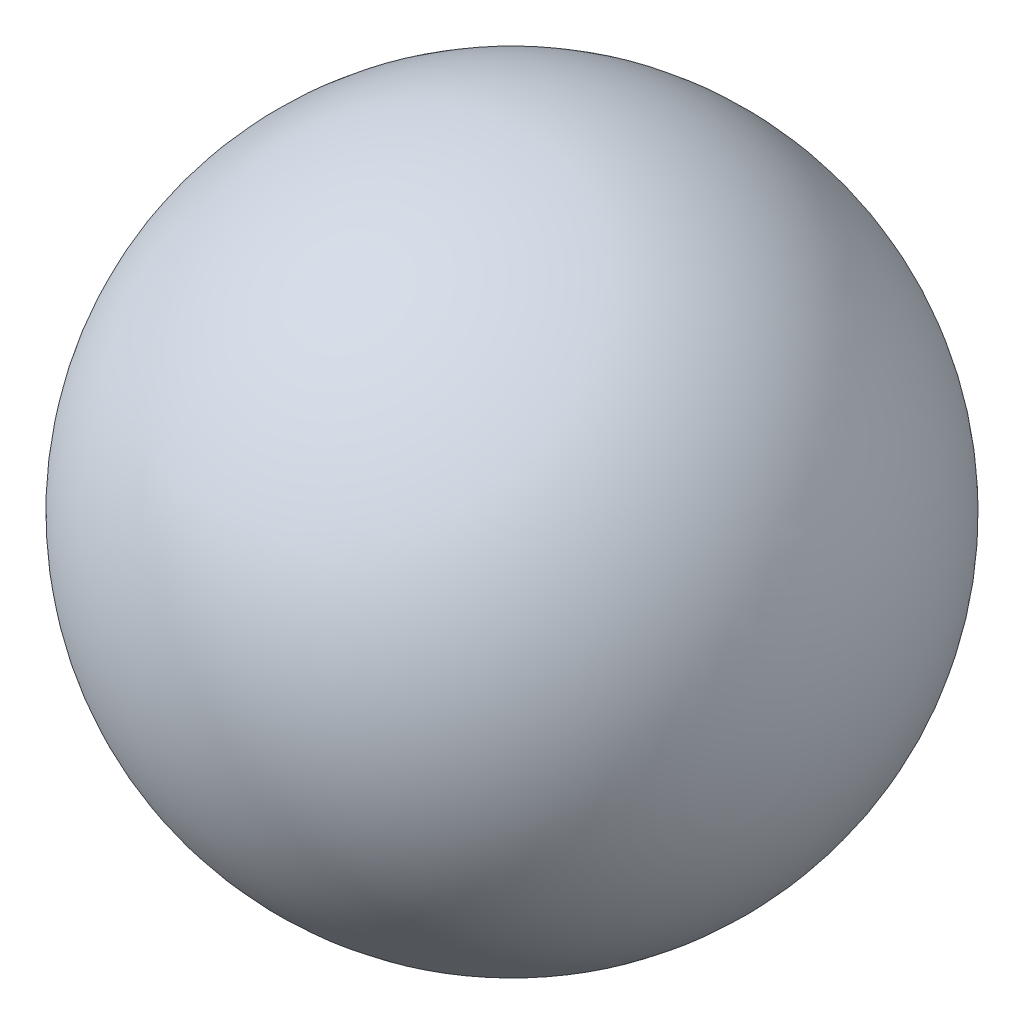
ISO-10303-21;
HEADER;
FILE_DESCRIPTION(('STEP AP214'),'2;1');
FILE_NAME('part.step','',(''),(''),'','','');
FILE_SCHEMA(('AUTOMOTIVE_DESIGN { 1 0 10303 214 1 1 1 1 }'));
ENDSEC;
DATA;
#1=APPLICATION_CONTEXT('core data for automotive mechanical design processes');
#2=APPLICATION_PROTOCOL_DEFINITION('international standard','automotive_design',2000,#1);
#3=PRODUCT_CONTEXT('',#1,'mechanical');
#4=PRODUCT('Part','Part','',(#3));
#5=PRODUCT_RELATED_PRODUCT_CATEGORY('part','',(#4));
#6=PRODUCT_DEFINITION_FORMATION('','',#4);
#7=PRODUCT_DEFINITION_CONTEXT('part definition',#1,'design');
#8=PRODUCT_DEFINITION('design','',#6,#7);
#9=PRODUCT_DEFINITION_SHAPE('','',#8);
#10=(LENGTH_UNIT() NAMED_UNIT(*) SI_UNIT(.MILLI.,.METRE.));
#11=(NAMED_UNIT(*) PLANE_ANGLE_UNIT() SI_UNIT($,.RADIAN.));
#12=(NAMED_UNIT(*) SI_UNIT($,.STERADIAN.) SOLID_ANGLE_UNIT());
#13=UNCERTAINTY_MEASURE_WITH_UNIT(LENGTH_MEASURE(1.E-05),#10,'distance_accuracy_value','');
#14=(GEOMETRIC_REPRESENTATION_CONTEXT(3) GLOBAL_UNCERTAINTY_ASSIGNED_CONTEXT((#13)) GLOBAL_UNIT_ASSIGNED_CONTEXT((#10,
#11,#12)) REPRESENTATION_CONTEXT('',''));
#15=CARTESIAN_POINT('',(0.,0.,0.));
#16=DIRECTION('',(0.,0.,1.));
#17=DIRECTION('',(1.,0.,0.));
#18=AXIS2_PLACEMENT_3D('',#15,#16,#17);
#19=CARTESIAN_POINT('',(0.,0.,0.));
#20=DIRECTION('',(0.,1.,0.));
#21=DIRECTION('',(1.,0.,0.));
#22=AXIS2_PLACEMENT_3D('',#19,#20,#21);
#23=SPHERICAL_SURFACE('',#22,12.7);
#24=CARTESIAN_POINT('',(0.,-12.4408087643047,0.));
#25=DIRECTION('',(0.,1.,0.));
#26=DIRECTION('',(0.,0.,1.));
#27=AXIS2_PLACEMENT_3D('',#24,#25,#26);
#28=CIRCLE('',#27,2.5527);
#29=CARTESIAN_POINT('',(0.,-12.4408087643047,2.5527));
#30=VERTEX_POINT('',#29);
#31=EDGE_CURVE('E11',#30,#30,#28,.F.);
#32=ORIENTED_EDGE('',*,*,#31,.F.);
#33=EDGE_LOOP('',(#32));
#34=FACE_BOUND('',#33,.T.);
#35=ADVANCED_FACE('F35',(#34),#23,.T.);
#36=CARTESIAN_POINT('',(0.,-6.35,0.));
#37=DIRECTION('',(0.,-1.,0.));
#38=DIRECTION('',(0.,0.,-1.));
#39=AXIS2_PLACEMENT_3D('',#36,#37,#38);
#40=CONICAL_SURFACE('',#39,2.5527,1.02974425867665);
#41=CARTESIAN_POINT('',(0.,-4.81618309780835,0.));
#42=VERTEX_POINT('',#41);
#43=VERTEX_LOOP('',#42);
#44=FACE_BOUND('',#43,.T.);
#45=CARTESIAN_POINT('',(0.,-6.35,0.));
#46=DIRECTION('',(0.,-1.,0.));
#47=DIRECTION('',(0.,0.,-1.));
#48=AXIS2_PLACEMENT_3D('',#45,#46,#47);
#49=CIRCLE('',#48,2.5527);
#50=CARTESIAN_POINT('',(0.,-6.35,-2.5527));
#51=VERTEX_POINT('',#50);
#52=EDGE_CURVE('E41',#51,#51,#49,.T.);
#53=ORIENTED_EDGE('',*,*,#52,.T.);
#54=EDGE_LOOP('',(#53));
#55=FACE_BOUND('',#54,.T.);
#56=ADVANCED_FACE('F44',(#44,#55),#40,.F.);
#57=CARTESIAN_POINT('',(0.,-12.7,0.));
#58=DIRECTION('',(0.,-1.,0.));
#59=DIRECTION('',(0.,0.,-1.));
#60=AXIS2_PLACEMENT_3D('',#57,#58,#59);
#61=CYLINDRICAL_SURFACE('',#60,2.5527);
#62=ORIENTED_EDGE('',*,*,#31,.T.);
#63=EDGE_LOOP('',(#62));
#64=FACE_BOUND('',#63,.T.);
#65=ORIENTED_EDGE('',*,*,#52,.F.);
#66=EDGE_LOOP('',(#65));
#67=FACE_BOUND('',#66,.T.);
#68=ADVANCED_FACE('F47',(#64,#67),#61,.F.);
#69=CLOSED_SHELL('',(#35,#56,#68));
#70=MANIFOLD_SOLID_BREP('B2',#69);
#71=ADVANCED_BREP_SHAPE_REPRESENTATION('',(#18,#70),#14);
#72=SHAPE_DEFINITION_REPRESENTATION(#9,#71);
ENDSEC;
END-ISO-10303-21;
